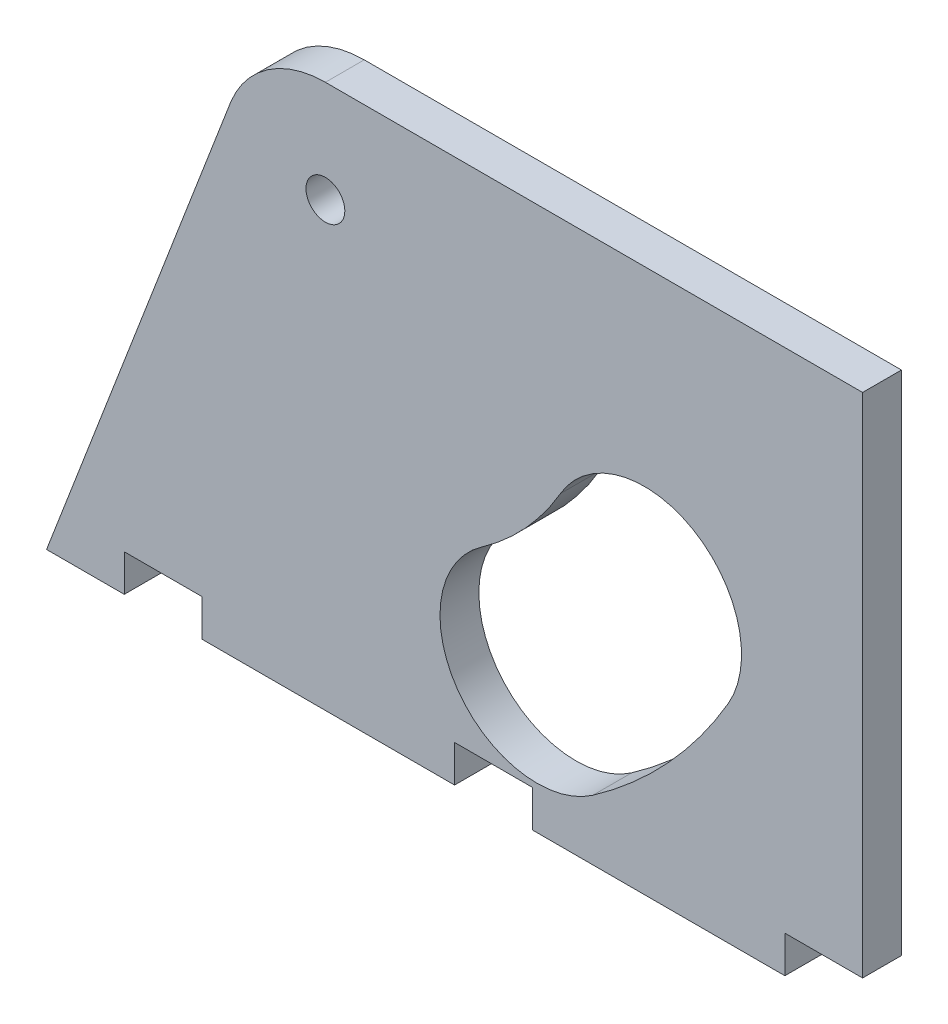
ISO-10303-21;
HEADER;
FILE_DESCRIPTION(('STEP AP214'),'2;1');
FILE_NAME('part.step','',(''),(''),'','','');
FILE_SCHEMA(('AUTOMOTIVE_DESIGN { 1 0 10303 214 1 1 1 1 }'));
ENDSEC;
DATA;
#1=APPLICATION_CONTEXT('core data for automotive mechanical design processes');
#2=APPLICATION_PROTOCOL_DEFINITION('international standard','automotive_design',2000,#1);
#3=PRODUCT_CONTEXT('',#1,'mechanical');
#4=PRODUCT('Part','Part','',(#3));
#5=PRODUCT_RELATED_PRODUCT_CATEGORY('part','',(#4));
#6=PRODUCT_DEFINITION_FORMATION('','',#4);
#7=PRODUCT_DEFINITION_CONTEXT('part definition',#1,'design');
#8=PRODUCT_DEFINITION('design','',#6,#7);
#9=PRODUCT_DEFINITION_SHAPE('','',#8);
#10=(LENGTH_UNIT() NAMED_UNIT(*) SI_UNIT(.MILLI.,.METRE.));
#11=(NAMED_UNIT(*) PLANE_ANGLE_UNIT() SI_UNIT($,.RADIAN.));
#12=(NAMED_UNIT(*) SI_UNIT($,.STERADIAN.) SOLID_ANGLE_UNIT());
#13=UNCERTAINTY_MEASURE_WITH_UNIT(LENGTH_MEASURE(1.E-05),#10,'distance_accuracy_value','');
#14=(GEOMETRIC_REPRESENTATION_CONTEXT(3) GLOBAL_UNCERTAINTY_ASSIGNED_CONTEXT((#13)) GLOBAL_UNIT_ASSIGNED_CONTEXT((#10,
#11,#12)) REPRESENTATION_CONTEXT('',''));
#15=CARTESIAN_POINT('',(0.,0.,0.));
#16=DIRECTION('',(0.,0.,1.));
#17=DIRECTION('',(1.,0.,0.));
#18=AXIS2_PLACEMENT_3D('',#15,#16,#17);
#19=CARTESIAN_POINT('',(0.,0.,5.));
#20=DIRECTION('',(0.,1.,0.));
#21=DIRECTION('',(0.,0.,1.));
#22=AXIS2_PLACEMENT_3D('',#19,#20,#21);
#23=PLANE('',#22);
#24=DIRECTION('',(1.,0.,0.));
#25=VECTOR('',#24,1.);
#26=CARTESIAN_POINT('',(15.,0.,5.));
#27=LINE('',#26,#25);
#28=CARTESIAN_POINT('',(15.,0.,5.));
#29=VERTEX_POINT('',#28);
#30=CARTESIAN_POINT('',(25.,0.,4.99999999999999));
#31=VERTEX_POINT('',#30);
#32=EDGE_CURVE('E193',#29,#31,#27,.T.);
#33=ORIENTED_EDGE('',*,*,#32,.T.);
#34=DIRECTION('',(0.,0.,1.));
#35=VECTOR('',#34,1.);
#36=CARTESIAN_POINT('',(25.,0.,4.99999999999999));
#37=LINE('',#36,#35);
#38=CARTESIAN_POINT('',(25.,0.,10.));
#39=VERTEX_POINT('',#38);
#40=EDGE_CURVE('E335',#31,#39,#37,.T.);
#41=ORIENTED_EDGE('',*,*,#40,.T.);
#42=DIRECTION('',(1.,0.,0.));
#43=VECTOR('',#42,1.);
#44=CARTESIAN_POINT('',(15.,0.,10.));
#45=LINE('',#44,#43);
#46=CARTESIAN_POINT('',(15.,0.,10.));
#47=VERTEX_POINT('',#46);
#48=EDGE_CURVE('E188',#47,#39,#45,.T.);
#49=ORIENTED_EDGE('',*,*,#48,.F.);
#50=DIRECTION('',(0.,0.,1.));
#51=VECTOR('',#50,1.);
#52=CARTESIAN_POINT('',(15.,0.,-20.));
#53=LINE('',#52,#51);
#54=EDGE_CURVE('E242',#29,#47,#53,.T.);
#55=ORIENTED_EDGE('',*,*,#54,.F.);
#56=EDGE_LOOP('',(#33,#41,#49,#55));
#57=FACE_BOUND('',#56,.T.);
#58=ADVANCED_FACE('F33',(#57),#23,.F.);
#59=CARTESIAN_POINT('',(35.,0.,10.));
#60=VERTEX_POINT('',#59);
#61=CARTESIAN_POINT('',(67.5,0.,10.));
#62=VERTEX_POINT('',#61);
#63=EDGE_CURVE('E195',#60,#62,#45,.T.);
#64=ORIENTED_EDGE('',*,*,#63,.F.);
#65=DIRECTION('',(0.,0.,1.));
#66=VECTOR('',#65,1.);
#67=CARTESIAN_POINT('',(35.,0.,4.99999999999999));
#68=LINE('',#67,#66);
#69=CARTESIAN_POINT('',(35.,0.,4.99999999999999));
#70=VERTEX_POINT('',#69);
#71=EDGE_CURVE('E347',#70,#60,#68,.T.);
#72=ORIENTED_EDGE('',*,*,#71,.F.);
#73=CARTESIAN_POINT('',(67.5,0.,4.99999999999999));
#74=VERTEX_POINT('',#73);
#75=EDGE_CURVE('E191',#70,#74,#27,.T.);
#76=ORIENTED_EDGE('',*,*,#75,.T.);
#77=DIRECTION('',(0.,0.,1.));
#78=VECTOR('',#77,1.);
#79=CARTESIAN_POINT('',(67.5,0.,4.99999999999999));
#80=LINE('',#79,#78);
#81=EDGE_CURVE('E358',#74,#62,#80,.T.);
#82=ORIENTED_EDGE('',*,*,#81,.T.);
#83=EDGE_LOOP('',(#64,#72,#76,#82));
#84=FACE_BOUND('',#83,.T.);
#85=ADVANCED_FACE('F291',(#84),#23,.F.);
#86=CARTESIAN_POINT('',(50.8780010361979,56.9097221037271,0.));
#87=DIRECTION('',(0.,0.,1.));
#88=DIRECTION('',(1.,0.,0.));
#89=AXIS2_PLACEMENT_3D('',#86,#87,#88);
#90=CYLINDRICAL_SURFACE('',#89,2.5);
#91=CARTESIAN_POINT('',(50.8780010361979,56.9097221037271,5.));
#92=DIRECTION('',(0.,0.,1.));
#93=DIRECTION('',(0.,-1.,0.));
#94=AXIS2_PLACEMENT_3D('',#91,#92,#93);
#95=CIRCLE('',#94,2.5);
#96=CARTESIAN_POINT('',(50.8780010361979,54.4097221037271,5.));
#97=VERTEX_POINT('',#96);
#98=EDGE_CURVE('E217',#97,#97,#95,.F.);
#99=ORIENTED_EDGE('',*,*,#98,.T.);
#100=EDGE_LOOP('',(#99));
#101=FACE_BOUND('',#100,.T.);
#102=CARTESIAN_POINT('',(50.8780010361979,56.9097221037271,10.));
#103=DIRECTION('',(0.,0.,1.));
#104=DIRECTION('',(1.,0.,0.));
#105=AXIS2_PLACEMENT_3D('',#102,#103,#104);
#106=CIRCLE('',#105,2.5);
#107=CARTESIAN_POINT('',(53.3780010361979,56.9097221037271,10.));
#108=VERTEX_POINT('',#107);
#109=EDGE_CURVE('E228',#108,#108,#106,.T.);
#110=ORIENTED_EDGE('',*,*,#109,.T.);
#111=EDGE_LOOP('',(#110));
#112=FACE_BOUND('',#111,.T.);
#113=ADVANCED_FACE('F296',(#101,#112),#90,.F.);
#114=CARTESIAN_POINT('',(50.8780010361979,56.9097221037271,0.));
#115=DIRECTION('',(0.,0.,1.));
#116=DIRECTION('',(1.,0.,0.));
#117=AXIS2_PLACEMENT_3D('',#114,#115,#116);
#118=CYLINDRICAL_SURFACE('',#117,60.);
#119=DIRECTION('',(0.,0.,1.));
#120=VECTOR('',#119,1.);
#121=CARTESIAN_POINT('',(102.722518982177,26.7079678674402,0.));
#122=LINE('',#121,#120);
#123=CARTESIAN_POINT('',(102.722518982177,26.7079678674402,5.));
#124=VERTEX_POINT('',#123);
#125=CARTESIAN_POINT('',(102.722518982177,26.7079678674402,10.));
#126=VERTEX_POINT('',#125);
#127=EDGE_CURVE('E257',#124,#126,#122,.T.);
#128=ORIENTED_EDGE('',*,*,#127,.F.);
#129=CARTESIAN_POINT('',(50.8780010361979,56.9097221037271,5.));
#130=DIRECTION('',(0.,0.,1.));
#131=DIRECTION('',(0.,-1.,0.));
#132=AXIS2_PLACEMENT_3D('',#129,#130,#131);
#133=CIRCLE('',#132,60.);
#134=CARTESIAN_POINT('',(85.2925872172608,7.76059944638762,4.99999999999999));
#135=VERTEX_POINT('',#134);
#136=EDGE_CURVE('E205',#124,#135,#133,.F.);
#137=ORIENTED_EDGE('',*,*,#136,.T.);
#138=DIRECTION('',(0.,0.,1.));
#139=VECTOR('',#138,1.);
#140=CARTESIAN_POINT('',(85.2925872172608,7.76059944638762,0.));
#141=LINE('',#140,#139);
#142=CARTESIAN_POINT('',(85.2925872172608,7.76059944638762,10.));
#143=VERTEX_POINT('',#142);
#144=EDGE_CURVE('E245',#135,#143,#141,.T.);
#145=ORIENTED_EDGE('',*,*,#144,.T.);
#146=CARTESIAN_POINT('',(50.8780010361979,56.9097221037271,10.));
#147=DIRECTION('',(0.,0.,1.));
#148=DIRECTION('',(1.,0.,0.));
#149=AXIS2_PLACEMENT_3D('',#146,#147,#148);
#150=CIRCLE('',#149,60.);
#151=EDGE_CURVE('E236',#143,#126,#150,.T.);
#152=ORIENTED_EDGE('',*,*,#151,.T.);
#153=EDGE_LOOP('',(#128,#137,#145,#152));
#154=FACE_BOUND('',#153,.T.);
#155=ADVANCED_FACE('F261',(#154),#118,.F.);
#156=CARTESIAN_POINT('',(91.9215777434313,33.,0.));
#157=DIRECTION('',(0.,0.,1.));
#158=DIRECTION('',(1.,0.,0.));
#159=AXIS2_PLACEMENT_3D('',#156,#157,#158);
#160=CYLINDRICAL_SURFACE('',#159,12.5);
#161=DIRECTION('',(0.,0.,1.));
#162=VECTOR('',#161,1.);
#163=CARTESIAN_POINT('',(81.1206365046857,39.2920321325597,0.));
#164=LINE('',#163,#162);
#165=CARTESIAN_POINT('',(81.1206365046857,39.2920321325597,5.));
#166=VERTEX_POINT('',#165);
#167=CARTESIAN_POINT('',(81.1206365046856,39.2920321325597,10.));
#168=VERTEX_POINT('',#167);
#169=EDGE_CURVE('E254',#166,#168,#164,.T.);
#170=ORIENTED_EDGE('',*,*,#169,.F.);
#171=CARTESIAN_POINT('',(91.9215777434313,33.,5.));
#172=DIRECTION('',(0.,0.,1.));
#173=DIRECTION('',(0.,-1.,0.));
#174=AXIS2_PLACEMENT_3D('',#171,#172,#173);
#175=CIRCLE('',#174,12.5);
#176=EDGE_CURVE('E208',#166,#124,#175,.F.);
#177=ORIENTED_EDGE('',*,*,#176,.T.);
#178=ORIENTED_EDGE('',*,*,#127,.T.);
#179=CARTESIAN_POINT('',(91.9215777434313,33.,10.));
#180=DIRECTION('',(0.,0.,1.));
#181=DIRECTION('',(1.,0.,0.));
#182=AXIS2_PLACEMENT_3D('',#179,#180,#181);
#183=CIRCLE('',#182,12.5);
#184=EDGE_CURVE('E234',#126,#168,#183,.T.);
#185=ORIENTED_EDGE('',*,*,#184,.T.);
#186=EDGE_LOOP('',(#170,#177,#178,#185));
#187=FACE_BOUND('',#186,.T.);
#188=ADVANCED_FACE('F274',(#187),#160,.F.);
#189=CARTESIAN_POINT('',(50.8780010361979,56.9097221037271,0.));
#190=DIRECTION('',(0.,0.,1.));
#191=DIRECTION('',(1.,0.,0.));
#192=AXIS2_PLACEMENT_3D('',#189,#190,#191);
#193=CYLINDRICAL_SURFACE('',#192,35.);
#194=DIRECTION('',(0.,0.,1.));
#195=VECTOR('',#194,1.);
#196=CARTESIAN_POINT('',(70.9531763084846,28.2394005536124,0.));
#197=LINE('',#196,#195);
#198=CARTESIAN_POINT('',(70.9531763084846,28.2394005536124,5.));
#199=VERTEX_POINT('',#198);
#200=CARTESIAN_POINT('',(70.9531763084846,28.2394005536124,10.));
#201=VERTEX_POINT('',#200);
#202=EDGE_CURVE('E41',#199,#201,#197,.T.);
#203=ORIENTED_EDGE('',*,*,#202,.F.);
#204=CARTESIAN_POINT('',(50.8780010361979,56.9097221037271,5.));
#205=DIRECTION('',(0.,0.,1.));
#206=DIRECTION('',(0.,-1.,0.));
#207=AXIS2_PLACEMENT_3D('',#204,#205,#206);
#208=CIRCLE('',#207,35.);
#209=EDGE_CURVE('E211',#199,#166,#208,.T.);
#210=ORIENTED_EDGE('',*,*,#209,.T.);
#211=ORIENTED_EDGE('',*,*,#169,.T.);
#212=CARTESIAN_POINT('',(50.8780010361979,56.9097221037271,10.));
#213=DIRECTION('',(0.,0.,-1.));
#214=DIRECTION('',(1.,0.,0.));
#215=AXIS2_PLACEMENT_3D('',#212,#213,#214);
#216=CIRCLE('',#215,35.);
#217=EDGE_CURVE('E232',#168,#201,#216,.T.);
#218=ORIENTED_EDGE('',*,*,#217,.T.);
#219=EDGE_LOOP('',(#203,#210,#211,#218));
#220=FACE_BOUND('',#219,.T.);
#221=ADVANCED_FACE('F276',(#220),#193,.T.);
#222=CARTESIAN_POINT('',(78.1228817628727,18.,0.));
#223=DIRECTION('',(0.,0.,1.));
#224=DIRECTION('',(1.,0.,0.));
#225=AXIS2_PLACEMENT_3D('',#222,#223,#224);
#226=CYLINDRICAL_SURFACE('',#225,12.5);
#227=ORIENTED_EDGE('',*,*,#144,.F.);
#228=CARTESIAN_POINT('',(78.1228817628727,18.,5.));
#229=DIRECTION('',(0.,0.,1.));
#230=DIRECTION('',(0.,-1.,0.));
#231=AXIS2_PLACEMENT_3D('',#228,#229,#230);
#232=CIRCLE('',#231,12.5);
#233=EDGE_CURVE('E214',#135,#199,#232,.F.);
#234=ORIENTED_EDGE('',*,*,#233,.T.);
#235=ORIENTED_EDGE('',*,*,#202,.T.);
#236=CARTESIAN_POINT('',(78.1228817628727,18.,10.));
#237=DIRECTION('',(0.,0.,1.));
#238=DIRECTION('',(1.,0.,0.));
#239=AXIS2_PLACEMENT_3D('',#236,#237,#238);
#240=CIRCLE('',#239,12.5);
#241=EDGE_CURVE('E229',#201,#143,#240,.T.);
#242=ORIENTED_EDGE('',*,*,#241,.T.);
#243=EDGE_LOOP('',(#227,#234,#235,#242));
#244=FACE_BOUND('',#243,.T.);
#245=ADVANCED_FACE('F266',(#244),#226,.F.);
#246=CARTESIAN_POINT('',(0.,0.,10.));
#247=DIRECTION('',(0.,0.,1.));
#248=DIRECTION('',(-1.,0.,0.));
#249=AXIS2_PLACEMENT_3D('',#246,#247,#248);
#250=PLANE('',#249);
#251=DIRECTION('',(0.,-1.,0.));
#252=VECTOR('',#251,1.);
#253=CARTESIAN_POINT('',(110.,0.,10.));
#254=LINE('',#253,#252);
#255=CARTESIAN_POINT('',(110.,4.75,10.));
#256=VERTEX_POINT('',#255);
#257=CARTESIAN_POINT('',(110.,0.,10.));
#258=VERTEX_POINT('',#257);
#259=EDGE_CURVE('E172',#256,#258,#254,.T.);
#260=ORIENTED_EDGE('',*,*,#259,.F.);
#261=DIRECTION('',(-1.,0.,0.));
#262=VECTOR('',#261,1.);
#263=CARTESIAN_POINT('',(120.,4.75,10.));
#264=LINE('',#263,#262);
#265=CARTESIAN_POINT('',(120.,4.75,10.));
#266=VERTEX_POINT('',#265);
#267=EDGE_CURVE('E321',#266,#256,#264,.T.);
#268=ORIENTED_EDGE('',*,*,#267,.F.);
#269=DIRECTION('',(0.,1.,0.));
#270=VECTOR('',#269,1.);
#271=CARTESIAN_POINT('',(120.,0.,10.));
#272=LINE('',#271,#270);
#273=CARTESIAN_POINT('',(120.,70.,10.));
#274=VERTEX_POINT('',#273);
#275=EDGE_CURVE('E181',#266,#274,#272,.T.);
#276=ORIENTED_EDGE('',*,*,#275,.T.);
#277=DIRECTION('',(-1.,0.,0.));
#278=VECTOR('',#277,1.);
#279=CARTESIAN_POINT('',(0.,70.,10.));
#280=LINE('',#279,#278);
#281=CARTESIAN_POINT('',(50.8780010361979,70.,10.));
#282=VERTEX_POINT('',#281);
#283=EDGE_CURVE('E222',#274,#282,#280,.T.);
#284=ORIENTED_EDGE('',*,*,#283,.T.);
#285=CARTESIAN_POINT('',(50.8780010361979,56.9097221037271,10.));
#286=DIRECTION('',(0.,0.,1.));
#287=DIRECTION('',(1.,0.,0.));
#288=AXIS2_PLACEMENT_3D('',#285,#286,#287);
#289=CIRCLE('',#288,13.0902778962729);
#290=CARTESIAN_POINT('',(38.6578920557703,61.602728806058,10.));
#291=VERTEX_POINT('',#290);
#292=EDGE_CURVE('E225',#282,#291,#289,.T.);
#293=ORIENTED_EDGE('',*,*,#292,.T.);
#294=DIRECTION('',(-0.358510853590599,-0.933525558224166,0.));
#295=VECTOR('',#294,1.);
#296=CARTESIAN_POINT('',(13.0720495178661,-5.02018567091379,10.));
#297=LINE('',#296,#295);
#298=EDGE_CURVE('E220',#291,#47,#297,.T.);
#299=ORIENTED_EDGE('',*,*,#298,.T.);
#300=ORIENTED_EDGE('',*,*,#48,.T.);
#301=DIRECTION('',(0.,-1.,0.));
#302=VECTOR('',#301,1.);
#303=CARTESIAN_POINT('',(25.,0.,10.));
#304=LINE('',#303,#302);
#305=CARTESIAN_POINT('',(25.,4.75,10.));
#306=VERTEX_POINT('',#305);
#307=EDGE_CURVE('E336',#306,#39,#304,.T.);
#308=ORIENTED_EDGE('',*,*,#307,.F.);
#309=DIRECTION('',(-1.,0.,0.));
#310=VECTOR('',#309,1.);
#311=CARTESIAN_POINT('',(25.,4.75,10.));
#312=LINE('',#311,#310);
#313=CARTESIAN_POINT('',(35.,4.75,10.));
#314=VERTEX_POINT('',#313);
#315=EDGE_CURVE('E331',#314,#306,#312,.T.);
#316=ORIENTED_EDGE('',*,*,#315,.F.);
#317=DIRECTION('',(0.,1.,0.));
#318=VECTOR('',#317,1.);
#319=CARTESIAN_POINT('',(35.,0.,10.));
#320=LINE('',#319,#318);
#321=EDGE_CURVE('E338',#60,#314,#320,.T.);
#322=ORIENTED_EDGE('',*,*,#321,.F.);
#323=ORIENTED_EDGE('',*,*,#63,.T.);
#324=DIRECTION('',(0.,-1.,0.));
#325=VECTOR('',#324,1.);
#326=CARTESIAN_POINT('',(67.5,0.,10.));
#327=LINE('',#326,#325);
#328=CARTESIAN_POINT('',(67.5,4.75,10.));
#329=VERTEX_POINT('',#328);
#330=EDGE_CURVE('E359',#329,#62,#327,.T.);
#331=ORIENTED_EDGE('',*,*,#330,.F.);
#332=DIRECTION('',(-1.,0.,0.));
#333=VECTOR('',#332,1.);
#334=CARTESIAN_POINT('',(67.5,4.75,10.));
#335=LINE('',#334,#333);
#336=CARTESIAN_POINT('',(77.5,4.75,10.));
#337=VERTEX_POINT('',#336);
#338=EDGE_CURVE('E354',#337,#329,#335,.T.);
#339=ORIENTED_EDGE('',*,*,#338,.F.);
#340=DIRECTION('',(0.,1.,0.));
#341=VECTOR('',#340,1.);
#342=CARTESIAN_POINT('',(77.5,0.,10.));
#343=LINE('',#342,#341);
#344=CARTESIAN_POINT('',(77.5,0.,10.));
#345=VERTEX_POINT('',#344);
#346=EDGE_CURVE('E361',#345,#337,#343,.T.);
#347=ORIENTED_EDGE('',*,*,#346,.F.);
#348=EDGE_CURVE('E197',#345,#258,#45,.T.);
#349=ORIENTED_EDGE('',*,*,#348,.T.);
#350=EDGE_LOOP('',(#260,#268,#276,#284,#293,#299,#300,#308,#316,#322,#323,#331,#339,#347,#349));
#351=FACE_BOUND('',#350,.T.);
#352=ORIENTED_EDGE('',*,*,#217,.F.);
#353=ORIENTED_EDGE('',*,*,#184,.F.);
#354=ORIENTED_EDGE('',*,*,#151,.F.);
#355=ORIENTED_EDGE('',*,*,#241,.F.);
#356=EDGE_LOOP('',(#352,#353,#354,#355));
#357=FACE_BOUND('',#356,.T.);
#358=ORIENTED_EDGE('',*,*,#109,.F.);
#359=EDGE_LOOP('',(#358));
#360=FACE_BOUND('',#359,.T.);
#361=ADVANCED_FACE('F270',(#351,#357,#360),#250,.T.);
#362=CARTESIAN_POINT('',(77.5,0.,4.99999999999999));
#363=VERTEX_POINT('',#362);
#364=CARTESIAN_POINT('',(110.,0.,4.99999999999999));
#365=VERTEX_POINT('',#364);
#366=EDGE_CURVE('E187',#363,#365,#27,.T.);
#367=ORIENTED_EDGE('',*,*,#366,.T.);
#368=DIRECTION('',(0.,0.,1.));
#369=VECTOR('',#368,1.);
#370=CARTESIAN_POINT('',(110.,0.,4.99999999999999));
#371=LINE('',#370,#369);
#372=EDGE_CURVE('E313',#365,#258,#371,.T.);
#373=ORIENTED_EDGE('',*,*,#372,.T.);
#374=ORIENTED_EDGE('',*,*,#348,.F.);
#375=DIRECTION('',(0.,0.,1.));
#376=VECTOR('',#375,1.);
#377=CARTESIAN_POINT('',(77.5,0.,4.99999999999999));
#378=LINE('',#377,#376);
#379=EDGE_CURVE('E315',#363,#345,#378,.T.);
#380=ORIENTED_EDGE('',*,*,#379,.F.);
#381=EDGE_LOOP('',(#367,#373,#374,#380));
#382=FACE_BOUND('',#381,.T.);
#383=ADVANCED_FACE('F35',(#382),#23,.F.);
#384=CARTESIAN_POINT('',(50.8780010361979,56.9097221037271,-20.));
#385=DIRECTION('',(0.,0.,1.));
#386=DIRECTION('',(1.,0.,0.));
#387=AXIS2_PLACEMENT_3D('',#384,#385,#386);
#388=CYLINDRICAL_SURFACE('',#387,13.0902778962729);
#389=DIRECTION('',(0.,0.,1.));
#390=VECTOR('',#389,1.);
#391=CARTESIAN_POINT('',(50.8780010361979,70.,-20.));
#392=LINE('',#391,#390);
#393=CARTESIAN_POINT('',(50.8780010361979,70.,5.));
#394=VERTEX_POINT('',#393);
#395=EDGE_CURVE('E246',#394,#282,#392,.T.);
#396=ORIENTED_EDGE('',*,*,#395,.F.);
#397=CARTESIAN_POINT('',(50.8780010361979,56.9097221037271,5.));
#398=DIRECTION('',(0.,0.,1.));
#399=DIRECTION('',(0.,-1.,0.));
#400=AXIS2_PLACEMENT_3D('',#397,#398,#399);
#401=CIRCLE('',#400,13.0902778962729);
#402=CARTESIAN_POINT('',(38.6578920557703,61.602728806058,5.));
#403=VERTEX_POINT('',#402);
#404=EDGE_CURVE('E11',#394,#403,#401,.T.);
#405=ORIENTED_EDGE('',*,*,#404,.T.);
#406=DIRECTION('',(0.,0.,1.));
#407=VECTOR('',#406,1.);
#408=CARTESIAN_POINT('',(38.6578920557703,61.602728806058,-20.));
#409=LINE('',#408,#407);
#410=EDGE_CURVE('E248',#403,#291,#409,.T.);
#411=ORIENTED_EDGE('',*,*,#410,.T.);
#412=ORIENTED_EDGE('',*,*,#292,.F.);
#413=EDGE_LOOP('',(#396,#405,#411,#412));
#414=FACE_BOUND('',#413,.T.);
#415=ADVANCED_FACE('F299',(#414),#388,.T.);
#416=CARTESIAN_POINT('',(120.,70.,-20.));
#417=DIRECTION('',(0.,-1.,0.));
#418=DIRECTION('',(1.,0.,0.));
#419=AXIS2_PLACEMENT_3D('',#416,#417,#418);
#420=PLANE('',#419);
#421=DIRECTION('',(0.,0.,1.));
#422=VECTOR('',#421,1.);
#423=CARTESIAN_POINT('',(120.,70.,-20.));
#424=LINE('',#423,#422);
#425=CARTESIAN_POINT('',(120.,70.,5.));
#426=VERTEX_POINT('',#425);
#427=EDGE_CURVE('E243',#426,#274,#424,.T.);
#428=ORIENTED_EDGE('',*,*,#427,.F.);
#429=DIRECTION('',(1.,0.,0.));
#430=VECTOR('',#429,1.);
#431=CARTESIAN_POINT('',(15.,70.,5.));
#432=LINE('',#431,#430);
#433=EDGE_CURVE('E186',#394,#426,#432,.T.);
#434=ORIENTED_EDGE('',*,*,#433,.F.);
#435=ORIENTED_EDGE('',*,*,#395,.T.);
#436=ORIENTED_EDGE('',*,*,#283,.F.);
#437=EDGE_LOOP('',(#428,#434,#435,#436));
#438=FACE_BOUND('',#437,.T.);
#439=ADVANCED_FACE('F305',(#438),#420,.F.);
#440=CARTESIAN_POINT('',(38.6578920557703,61.602728806058,-20.));
#441=DIRECTION('',(0.933525558224166,-0.358510853590599,0.));
#442=DIRECTION('',(0.358510853590599,0.933525558224166,0.));
#443=AXIS2_PLACEMENT_3D('',#440,#441,#442);
#444=PLANE('',#443);
#445=ORIENTED_EDGE('',*,*,#54,.T.);
#446=ORIENTED_EDGE('',*,*,#298,.F.);
#447=ORIENTED_EDGE('',*,*,#410,.F.);
#448=DIRECTION('',(-0.358510853590599,-0.933525558224166,0.));
#449=VECTOR('',#448,1.);
#450=CARTESIAN_POINT('',(38.6578920557703,61.602728806058,5.));
#451=LINE('',#450,#449);
#452=EDGE_CURVE('E200',#403,#29,#451,.T.);
#453=ORIENTED_EDGE('',*,*,#452,.T.);
#454=EDGE_LOOP('',(#445,#446,#447,#453));
#455=FACE_BOUND('',#454,.T.);
#456=ADVANCED_FACE('F288',(#455),#444,.F.);
#457=CARTESIAN_POINT('',(120.,0.,5.));
#458=DIRECTION('',(-1.,0.,0.));
#459=DIRECTION('',(0.,-1.,0.));
#460=AXIS2_PLACEMENT_3D('',#457,#458,#459);
#461=PLANE('',#460);
#462=ORIENTED_EDGE('',*,*,#275,.F.);
#463=DIRECTION('',(0.,0.,1.));
#464=VECTOR('',#463,1.);
#465=CARTESIAN_POINT('',(120.,4.75,4.99999999999999));
#466=LINE('',#465,#464);
#467=CARTESIAN_POINT('',(120.,4.75,4.99999999999999));
#468=VERTEX_POINT('',#467);
#469=EDGE_CURVE('E167',#468,#266,#466,.T.);
#470=ORIENTED_EDGE('',*,*,#469,.F.);
#471=DIRECTION('',(0.,-1.,0.));
#472=VECTOR('',#471,1.);
#473=CARTESIAN_POINT('',(120.,70.,5.));
#474=LINE('',#473,#472);
#475=EDGE_CURVE('E179',#426,#468,#474,.T.);
#476=ORIENTED_EDGE('',*,*,#475,.F.);
#477=ORIENTED_EDGE('',*,*,#427,.T.);
#478=EDGE_LOOP('',(#462,#470,#476,#477));
#479=FACE_BOUND('',#478,.T.);
#480=ADVANCED_FACE('F177',(#479),#461,.F.);
#481=CARTESIAN_POINT('',(0.,0.,5.));
#482=DIRECTION('',(0.,0.,1.));
#483=DIRECTION('',(-1.,0.,0.));
#484=AXIS2_PLACEMENT_3D('',#481,#482,#483);
#485=PLANE('',#484);
#486=ORIENTED_EDGE('',*,*,#136,.F.);
#487=ORIENTED_EDGE('',*,*,#176,.F.);
#488=ORIENTED_EDGE('',*,*,#209,.F.);
#489=ORIENTED_EDGE('',*,*,#233,.F.);
#490=EDGE_LOOP('',(#486,#487,#488,#489));
#491=FACE_BOUND('',#490,.T.);
#492=DIRECTION('',(-1.,0.,0.));
#493=VECTOR('',#492,1.);
#494=CARTESIAN_POINT('',(120.,4.75,4.99999999999999));
#495=LINE('',#494,#493);
#496=CARTESIAN_POINT('',(110.,4.75,5.));
#497=VERTEX_POINT('',#496);
#498=EDGE_CURVE('E163',#468,#497,#495,.T.);
#499=ORIENTED_EDGE('',*,*,#498,.T.);
#500=DIRECTION('',(0.,-1.,0.));
#501=VECTOR('',#500,1.);
#502=CARTESIAN_POINT('',(110.,0.,4.99999999999999));
#503=LINE('',#502,#501);
#504=EDGE_CURVE('E48',#497,#365,#503,.T.);
#505=ORIENTED_EDGE('',*,*,#504,.T.);
#506=ORIENTED_EDGE('',*,*,#366,.F.);
#507=DIRECTION('',(0.,1.,0.));
#508=VECTOR('',#507,1.);
#509=CARTESIAN_POINT('',(77.5,0.,4.99999999999999));
#510=LINE('',#509,#508);
#511=CARTESIAN_POINT('',(77.5,4.75,5.));
#512=VERTEX_POINT('',#511);
#513=EDGE_CURVE('E318',#363,#512,#510,.T.);
#514=ORIENTED_EDGE('',*,*,#513,.T.);
#515=DIRECTION('',(-1.,0.,0.));
#516=VECTOR('',#515,1.);
#517=CARTESIAN_POINT('',(67.5,4.75,4.99999999999999));
#518=LINE('',#517,#516);
#519=CARTESIAN_POINT('',(67.5,4.75,4.99999999999999));
#520=VERTEX_POINT('',#519);
#521=EDGE_CURVE('E356',#512,#520,#518,.T.);
#522=ORIENTED_EDGE('',*,*,#521,.T.);
#523=DIRECTION('',(0.,-1.,0.));
#524=VECTOR('',#523,1.);
#525=CARTESIAN_POINT('',(67.5,0.,4.99999999999999));
#526=LINE('',#525,#524);
#527=EDGE_CURVE('E351',#520,#74,#526,.T.);
#528=ORIENTED_EDGE('',*,*,#527,.T.);
#529=ORIENTED_EDGE('',*,*,#75,.F.);
#530=DIRECTION('',(0.,1.,0.));
#531=VECTOR('',#530,1.);
#532=CARTESIAN_POINT('',(35.,0.,4.99999999999999));
#533=LINE('',#532,#531);
#534=CARTESIAN_POINT('',(35.,4.75,5.));
#535=VERTEX_POINT('',#534);
#536=EDGE_CURVE('E330',#70,#535,#533,.T.);
#537=ORIENTED_EDGE('',*,*,#536,.T.);
#538=DIRECTION('',(-1.,0.,0.));
#539=VECTOR('',#538,1.);
#540=CARTESIAN_POINT('',(25.,4.75,4.99999999999999));
#541=LINE('',#540,#539);
#542=CARTESIAN_POINT('',(25.,4.75,4.99999999999999));
#543=VERTEX_POINT('',#542);
#544=EDGE_CURVE('E56',#535,#543,#541,.T.);
#545=ORIENTED_EDGE('',*,*,#544,.T.);
#546=DIRECTION('',(0.,-1.,0.));
#547=VECTOR('',#546,1.);
#548=CARTESIAN_POINT('',(25.,0.,4.99999999999999));
#549=LINE('',#548,#547);
#550=EDGE_CURVE('E327',#543,#31,#549,.T.);
#551=ORIENTED_EDGE('',*,*,#550,.T.);
#552=ORIENTED_EDGE('',*,*,#32,.F.);
#553=ORIENTED_EDGE('',*,*,#452,.F.);
#554=ORIENTED_EDGE('',*,*,#404,.F.);
#555=ORIENTED_EDGE('',*,*,#433,.T.);
#556=ORIENTED_EDGE('',*,*,#475,.T.);
#557=EDGE_LOOP('',(#499,#505,#506,#514,#522,#528,#529,#537,#545,#551,#552,#553,#554,#555,#556));
#558=FACE_BOUND('',#557,.T.);
#559=ORIENTED_EDGE('',*,*,#98,.F.);
#560=EDGE_LOOP('',(#559));
#561=FACE_BOUND('',#560,.T.);
#562=ADVANCED_FACE('F183',(#491,#558,#561),#485,.F.);
#563=CARTESIAN_POINT('',(67.5,0.,4.99999999999999));
#564=DIRECTION('',(-1.,0.,0.));
#565=DIRECTION('',(0.,0.,1.));
#566=AXIS2_PLACEMENT_3D('',#563,#564,#565);
#567=PLANE('',#566);
#568=ORIENTED_EDGE('',*,*,#330,.T.);
#569=ORIENTED_EDGE('',*,*,#81,.F.);
#570=ORIENTED_EDGE('',*,*,#527,.F.);
#571=DIRECTION('',(0.,0.,1.));
#572=VECTOR('',#571,1.);
#573=CARTESIAN_POINT('',(67.5,4.75,4.99999999999999));
#574=LINE('',#573,#572);
#575=EDGE_CURVE('E339',#520,#329,#574,.T.);
#576=ORIENTED_EDGE('',*,*,#575,.T.);
#577=EDGE_LOOP('',(#568,#569,#570,#576));
#578=FACE_BOUND('',#577,.T.);
#579=ADVANCED_FACE('F279',(#578),#567,.F.);
#580=CARTESIAN_POINT('',(67.5,4.75,4.99999999999999));
#581=DIRECTION('',(0.,1.,0.));
#582=DIRECTION('',(-1.,0.,0.));
#583=AXIS2_PLACEMENT_3D('',#580,#581,#582);
#584=PLANE('',#583);
#585=ORIENTED_EDGE('',*,*,#338,.T.);
#586=ORIENTED_EDGE('',*,*,#575,.F.);
#587=ORIENTED_EDGE('',*,*,#521,.F.);
#588=DIRECTION('',(0.,0.,1.));
#589=VECTOR('',#588,1.);
#590=CARTESIAN_POINT('',(77.5,4.75,4.99999999999999));
#591=LINE('',#590,#589);
#592=EDGE_CURVE('E367',#512,#337,#591,.T.);
#593=ORIENTED_EDGE('',*,*,#592,.T.);
#594=EDGE_LOOP('',(#585,#586,#587,#593));
#595=FACE_BOUND('',#594,.T.);
#596=ADVANCED_FACE('F285',(#595),#584,.F.);
#597=CARTESIAN_POINT('',(77.5,0.,4.99999999999999));
#598=DIRECTION('',(1.,0.,0.));
#599=DIRECTION('',(0.,0.,-1.));
#600=AXIS2_PLACEMENT_3D('',#597,#598,#599);
#601=PLANE('',#600);
#602=ORIENTED_EDGE('',*,*,#346,.T.);
#603=ORIENTED_EDGE('',*,*,#592,.F.);
#604=ORIENTED_EDGE('',*,*,#513,.F.);
#605=ORIENTED_EDGE('',*,*,#379,.T.);
#606=EDGE_LOOP('',(#602,#603,#604,#605));
#607=FACE_BOUND('',#606,.T.);
#608=ADVANCED_FACE('F384',(#607),#601,.F.);
#609=CARTESIAN_POINT('',(25.,0.,4.99999999999999));
#610=DIRECTION('',(-1.,0.,0.));
#611=DIRECTION('',(0.,0.,1.));
#612=AXIS2_PLACEMENT_3D('',#609,#610,#611);
#613=PLANE('',#612);
#614=ORIENTED_EDGE('',*,*,#307,.T.);
#615=ORIENTED_EDGE('',*,*,#40,.F.);
#616=ORIENTED_EDGE('',*,*,#550,.F.);
#617=DIRECTION('',(0.,0.,1.));
#618=VECTOR('',#617,1.);
#619=CARTESIAN_POINT('',(25.,4.75,4.99999999999999));
#620=LINE('',#619,#618);
#621=EDGE_CURVE('E323',#543,#306,#620,.T.);
#622=ORIENTED_EDGE('',*,*,#621,.T.);
#623=EDGE_LOOP('',(#614,#615,#616,#622));
#624=FACE_BOUND('',#623,.T.);
#625=ADVANCED_FACE('F393',(#624),#613,.F.);
#626=CARTESIAN_POINT('',(25.,4.75,4.99999999999999));
#627=DIRECTION('',(0.,1.,0.));
#628=DIRECTION('',(0.,0.,1.));
#629=AXIS2_PLACEMENT_3D('',#626,#627,#628);
#630=PLANE('',#629);
#631=ORIENTED_EDGE('',*,*,#315,.T.);
#632=ORIENTED_EDGE('',*,*,#621,.F.);
#633=ORIENTED_EDGE('',*,*,#544,.F.);
#634=DIRECTION('',(0.,0.,1.));
#635=VECTOR('',#634,1.);
#636=CARTESIAN_POINT('',(35.,4.75,4.99999999999999));
#637=LINE('',#636,#635);
#638=EDGE_CURVE('E345',#535,#314,#637,.T.);
#639=ORIENTED_EDGE('',*,*,#638,.T.);
#640=EDGE_LOOP('',(#631,#632,#633,#639));
#641=FACE_BOUND('',#640,.T.);
#642=ADVANCED_FACE('F388',(#641),#630,.F.);
#643=CARTESIAN_POINT('',(35.,0.,4.99999999999999));
#644=DIRECTION('',(1.,0.,0.));
#645=DIRECTION('',(0.,0.,-1.));
#646=AXIS2_PLACEMENT_3D('',#643,#644,#645);
#647=PLANE('',#646);
#648=ORIENTED_EDGE('',*,*,#321,.T.);
#649=ORIENTED_EDGE('',*,*,#638,.F.);
#650=ORIENTED_EDGE('',*,*,#536,.F.);
#651=ORIENTED_EDGE('',*,*,#71,.T.);
#652=EDGE_LOOP('',(#648,#649,#650,#651));
#653=FACE_BOUND('',#652,.T.);
#654=ADVANCED_FACE('F387',(#653),#647,.F.);
#655=CARTESIAN_POINT('',(110.,0.,4.99999999999999));
#656=DIRECTION('',(-1.,0.,0.));
#657=DIRECTION('',(0.,0.,1.));
#658=AXIS2_PLACEMENT_3D('',#655,#656,#657);
#659=PLANE('',#658);
#660=ORIENTED_EDGE('',*,*,#259,.T.);
#661=ORIENTED_EDGE('',*,*,#372,.F.);
#662=ORIENTED_EDGE('',*,*,#504,.F.);
#663=DIRECTION('',(0.,0.,1.));
#664=VECTOR('',#663,1.);
#665=CARTESIAN_POINT('',(110.,4.75,4.99999999999999));
#666=LINE('',#665,#664);
#667=EDGE_CURVE('E169',#497,#256,#666,.T.);
#668=ORIENTED_EDGE('',*,*,#667,.T.);
#669=EDGE_LOOP('',(#660,#661,#662,#668));
#670=FACE_BOUND('',#669,.T.);
#671=ADVANCED_FACE('F517',(#670),#659,.F.);
#672=CARTESIAN_POINT('',(120.,4.75,4.99999999999999));
#673=DIRECTION('',(0.,1.,0.));
#674=DIRECTION('',(-1.,0.,0.));
#675=AXIS2_PLACEMENT_3D('',#672,#673,#674);
#676=PLANE('',#675);
#677=ORIENTED_EDGE('',*,*,#267,.T.);
#678=ORIENTED_EDGE('',*,*,#667,.F.);
#679=ORIENTED_EDGE('',*,*,#498,.F.);
#680=ORIENTED_EDGE('',*,*,#469,.T.);
#681=EDGE_LOOP('',(#677,#678,#679,#680));
#682=FACE_BOUND('',#681,.T.);
#683=ADVANCED_FACE('F166',(#682),#676,.F.);
#684=CLOSED_SHELL('',(#58,#85,#113,#155,#188,#221,#245,#361,#383,#415,#439,#456,#480,#562,#579,
#596,#608,#625,#642,#654,#671,#683));
#685=MANIFOLD_SOLID_BREP('B2',#684);
#686=ADVANCED_BREP_SHAPE_REPRESENTATION('',(#18,#685),#14);
#687=SHAPE_DEFINITION_REPRESENTATION(#9,#686);
ENDSEC;
END-ISO-10303-21;
